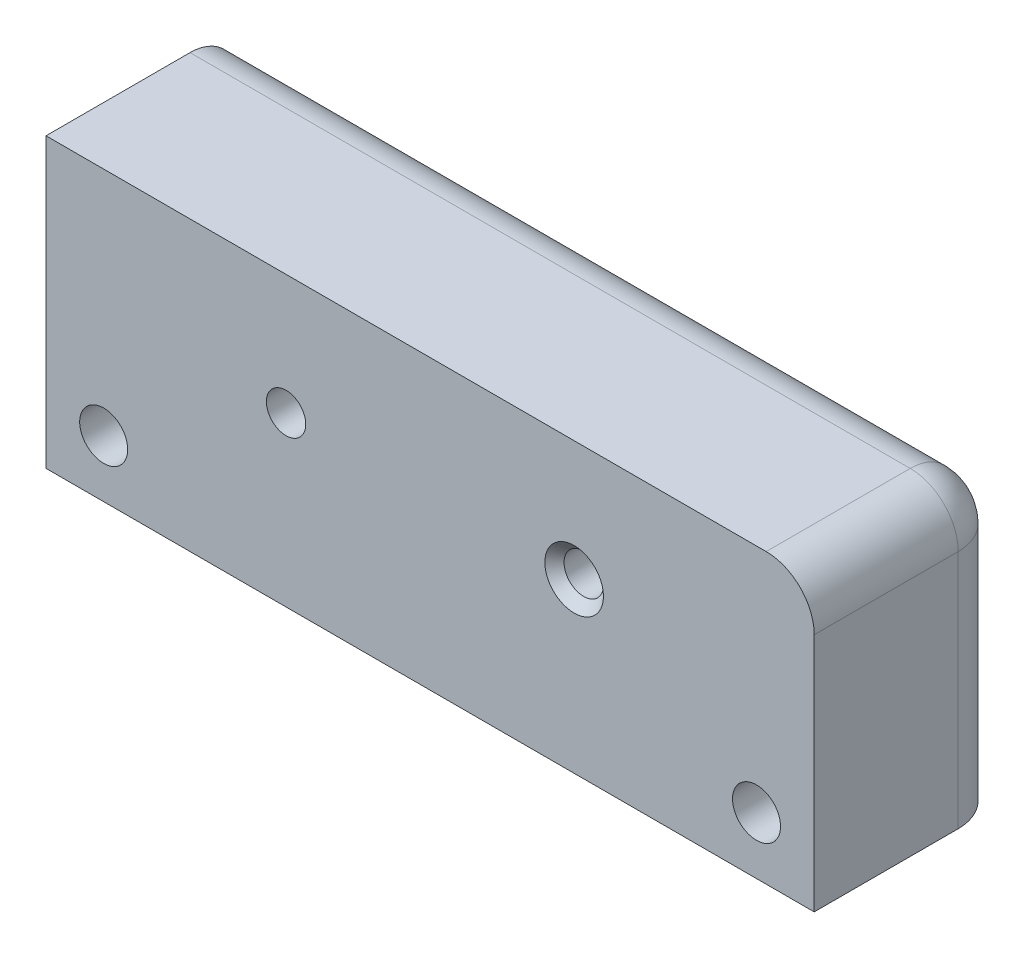
ISO-10303-21;
HEADER;
FILE_DESCRIPTION(('STEP AP214'),'2;1');
FILE_NAME('part.step','',(''),(''),'','','');
FILE_SCHEMA(('AUTOMOTIVE_DESIGN { 1 0 10303 214 1 1 1 1 }'));
ENDSEC;
DATA;
#1=APPLICATION_CONTEXT('core data for automotive mechanical design processes');
#2=APPLICATION_PROTOCOL_DEFINITION('international standard','automotive_design',2000,#1);
#3=PRODUCT_CONTEXT('',#1,'mechanical');
#4=PRODUCT('Part','Part','',(#3));
#5=PRODUCT_RELATED_PRODUCT_CATEGORY('part','',(#4));
#6=PRODUCT_DEFINITION_FORMATION('','',#4);
#7=PRODUCT_DEFINITION_CONTEXT('part definition',#1,'design');
#8=PRODUCT_DEFINITION('design','',#6,#7);
#9=PRODUCT_DEFINITION_SHAPE('','',#8);
#10=(LENGTH_UNIT() NAMED_UNIT(*) SI_UNIT(.MILLI.,.METRE.));
#11=(NAMED_UNIT(*) PLANE_ANGLE_UNIT() SI_UNIT($,.RADIAN.));
#12=(NAMED_UNIT(*) SI_UNIT($,.STERADIAN.) SOLID_ANGLE_UNIT());
#13=UNCERTAINTY_MEASURE_WITH_UNIT(LENGTH_MEASURE(1.E-05),#10,'distance_accuracy_value','');
#14=(GEOMETRIC_REPRESENTATION_CONTEXT(3) GLOBAL_UNCERTAINTY_ASSIGNED_CONTEXT((#13)) GLOBAL_UNIT_ASSIGNED_CONTEXT((#10,
#11,#12)) REPRESENTATION_CONTEXT('',''));
#15=CARTESIAN_POINT('',(0.,0.,0.));
#16=DIRECTION('',(0.,0.,1.));
#17=DIRECTION('',(1.,0.,0.));
#18=AXIS2_PLACEMENT_3D('',#15,#16,#17);
#19=CARTESIAN_POINT('',(0.,60.,0.));
#20=DIRECTION('',(1.,0.,0.));
#21=DIRECTION('',(0.,0.,-1.));
#22=AXIS2_PLACEMENT_3D('',#19,#20,#21);
#23=PLANE('',#22);
#24=DIRECTION('',(0.,0.,1.));
#25=VECTOR('',#24,1.);
#26=CARTESIAN_POINT('',(0.,60.,0.));
#27=LINE('',#26,#25);
#28=CARTESIAN_POINT('',(0.,60.,-30.));
#29=VERTEX_POINT('',#28);
#30=CARTESIAN_POINT('',(0.,60.,0.));
#31=VERTEX_POINT('',#30);
#32=EDGE_CURVE('E127',#29,#31,#27,.T.);
#33=ORIENTED_EDGE('',*,*,#32,.F.);
#34=CARTESIAN_POINT('',(0.,50.,-30.));
#35=DIRECTION('',(1.,0.,0.));
#36=DIRECTION('',(0.,0.,-1.));
#37=AXIS2_PLACEMENT_3D('',#34,#35,#36);
#38=CIRCLE('',#37,10.);
#39=CARTESIAN_POINT('',(0.,50.,-40.));
#40=VERTEX_POINT('',#39);
#41=EDGE_CURVE('E188',#29,#40,#38,.F.);
#42=ORIENTED_EDGE('',*,*,#41,.T.);
#43=DIRECTION('',(0.,-1.,0.));
#44=VECTOR('',#43,1.);
#45=CARTESIAN_POINT('',(0.,60.,-40.));
#46=LINE('',#45,#44);
#47=CARTESIAN_POINT('',(0.,0.,-40.));
#48=VERTEX_POINT('',#47);
#49=EDGE_CURVE('E133',#40,#48,#46,.T.);
#50=ORIENTED_EDGE('',*,*,#49,.T.);
#51=DIRECTION('',(0.,0.,1.));
#52=VECTOR('',#51,1.);
#53=CARTESIAN_POINT('',(0.,0.,0.));
#54=LINE('',#53,#52);
#55=CARTESIAN_POINT('',(0.,0.,0.));
#56=VERTEX_POINT('',#55);
#57=EDGE_CURVE('E124',#48,#56,#54,.T.);
#58=ORIENTED_EDGE('',*,*,#57,.T.);
#59=DIRECTION('',(0.,-1.,0.));
#60=VECTOR('',#59,1.);
#61=CARTESIAN_POINT('',(0.,60.,0.));
#62=LINE('',#61,#60);
#63=EDGE_CURVE('E121',#31,#56,#62,.T.);
#64=ORIENTED_EDGE('',*,*,#63,.F.);
#65=EDGE_LOOP('',(#33,#42,#50,#58,#64));
#66=FACE_BOUND('',#65,.T.);
#67=ADVANCED_FACE('F36',(#66),#23,.F.);
#68=CARTESIAN_POINT('',(0.,60.,0.));
#69=DIRECTION('',(0.,0.,-1.));
#70=DIRECTION('',(-1.,0.,0.));
#71=AXIS2_PLACEMENT_3D('',#68,#69,#70);
#72=PLANE('',#71);
#73=CARTESIAN_POINT('',(110.,35.,0.));
#74=DIRECTION('',(0.,0.,-1.));
#75=DIRECTION('',(-1.,0.,0.));
#76=AXIS2_PLACEMENT_3D('',#73,#74,#75);
#77=CIRCLE('',#76,6.09999999999999);
#78=CARTESIAN_POINT('',(103.9,35.,0.));
#79=VERTEX_POINT('',#78);
#80=EDGE_CURVE('E44',#79,#79,#77,.T.);
#81=ORIENTED_EDGE('',*,*,#80,.T.);
#82=EDGE_LOOP('',(#81));
#83=FACE_BOUND('',#82,.T.);
#84=CARTESIAN_POINT('',(50.,35.,0.));
#85=DIRECTION('',(0.,0.,1.));
#86=DIRECTION('',(1.,0.,0.));
#87=AXIS2_PLACEMENT_3D('',#84,#85,#86);
#88=CIRCLE('',#87,4.09999999999999);
#89=CARTESIAN_POINT('',(54.1,35.,0.));
#90=VERTEX_POINT('',#89);
#91=EDGE_CURVE('E105',#90,#90,#88,.T.);
#92=ORIENTED_EDGE('',*,*,#91,.F.);
#93=EDGE_LOOP('',(#92));
#94=FACE_BOUND('',#93,.T.);
#95=CARTESIAN_POINT('',(12.0133308099639,11.9072218747647,0.));
#96=DIRECTION('',(0.,0.,1.));
#97=DIRECTION('',(1.,0.,0.));
#98=AXIS2_PLACEMENT_3D('',#95,#96,#97);
#99=CIRCLE('',#98,5.);
#100=CARTESIAN_POINT('',(17.0133308099639,11.9072218747647,0.));
#101=VERTEX_POINT('',#100);
#102=EDGE_CURVE('E194',#101,#101,#99,.T.);
#103=ORIENTED_EDGE('',*,*,#102,.F.);
#104=EDGE_LOOP('',(#103));
#105=FACE_BOUND('',#104,.T.);
#106=DIRECTION('',(0.,-1.,0.));
#107=VECTOR('',#106,1.);
#108=CARTESIAN_POINT('',(160.,60.,0.));
#109=LINE('',#108,#107);
#110=CARTESIAN_POINT('',(160.,50.,0.));
#111=VERTEX_POINT('',#110);
#112=CARTESIAN_POINT('',(160.,0.,0.));
#113=VERTEX_POINT('',#112);
#114=EDGE_CURVE('E98',#111,#113,#109,.T.);
#115=ORIENTED_EDGE('',*,*,#114,.F.);
#116=CARTESIAN_POINT('',(150.,50.,0.));
#117=DIRECTION('',(0.,0.,-1.));
#118=DIRECTION('',(-1.,0.,0.));
#119=AXIS2_PLACEMENT_3D('',#116,#117,#118);
#120=CIRCLE('',#119,10.);
#121=CARTESIAN_POINT('',(150.,60.,0.));
#122=VERTEX_POINT('',#121);
#123=EDGE_CURVE('E224',#111,#122,#120,.F.);
#124=ORIENTED_EDGE('',*,*,#123,.T.);
#125=DIRECTION('',(1.,0.,0.));
#126=VECTOR('',#125,1.);
#127=CARTESIAN_POINT('',(0.,60.,0.));
#128=LINE('',#127,#126);
#129=EDGE_CURVE('E135',#31,#122,#128,.T.);
#130=ORIENTED_EDGE('',*,*,#129,.F.);
#131=ORIENTED_EDGE('',*,*,#63,.T.);
#132=DIRECTION('',(1.,0.,0.));
#133=VECTOR('',#132,1.);
#134=CARTESIAN_POINT('',(0.,0.,0.));
#135=LINE('',#134,#133);
#136=EDGE_CURVE('E111',#56,#113,#135,.T.);
#137=ORIENTED_EDGE('',*,*,#136,.T.);
#138=EDGE_LOOP('',(#115,#124,#130,#131,#137));
#139=FACE_BOUND('',#138,.T.);
#140=CARTESIAN_POINT('',(147.986669190036,11.9072218747647,0.));
#141=DIRECTION('',(0.,0.,-1.));
#142=DIRECTION('',(-1.,0.,0.));
#143=AXIS2_PLACEMENT_3D('',#140,#141,#142);
#144=CIRCLE('',#143,5.);
#145=CARTESIAN_POINT('',(142.986669190036,11.9072218747647,0.));
#146=VERTEX_POINT('',#145);
#147=EDGE_CURVE('E204',#146,#146,#144,.T.);
#148=ORIENTED_EDGE('',*,*,#147,.T.);
#149=EDGE_LOOP('',(#148));
#150=FACE_BOUND('',#149,.T.);
#151=ADVANCED_FACE('F117',(#83,#94,#105,#139,#150),#72,.F.);
#152=CARTESIAN_POINT('',(0.,60.,-40.));
#153=DIRECTION('',(0.,0.,1.));
#154=DIRECTION('',(1.,0.,0.));
#155=AXIS2_PLACEMENT_3D('',#152,#153,#154);
#156=PLANE('',#155);
#157=CARTESIAN_POINT('',(50.,35.,-40.));
#158=DIRECTION('',(0.,0.,1.));
#159=DIRECTION('',(1.,0.,0.));
#160=AXIS2_PLACEMENT_3D('',#157,#158,#159);
#161=CIRCLE('',#160,4.09999999999999);
#162=CARTESIAN_POINT('',(54.1,35.,-40.));
#163=VERTEX_POINT('',#162);
#164=EDGE_CURVE('E197',#163,#163,#161,.T.);
#165=ORIENTED_EDGE('',*,*,#164,.T.);
#166=EDGE_LOOP('',(#165));
#167=FACE_BOUND('',#166,.T.);
#168=CARTESIAN_POINT('',(12.0133308099639,11.9072218747647,-40.));
#169=DIRECTION('',(0.,0.,1.));
#170=DIRECTION('',(1.,0.,0.));
#171=AXIS2_PLACEMENT_3D('',#168,#169,#170);
#172=CIRCLE('',#171,5.);
#173=CARTESIAN_POINT('',(17.0133308099639,11.9072218747647,-40.));
#174=VERTEX_POINT('',#173);
#175=EDGE_CURVE('E129',#174,#174,#172,.T.);
#176=ORIENTED_EDGE('',*,*,#175,.T.);
#177=EDGE_LOOP('',(#176));
#178=FACE_BOUND('',#177,.T.);
#179=CARTESIAN_POINT('',(110.,35.,-40.));
#180=DIRECTION('',(0.,0.,-1.));
#181=DIRECTION('',(-1.,0.,0.));
#182=AXIS2_PLACEMENT_3D('',#179,#180,#181);
#183=CIRCLE('',#182,4.09999999999999);
#184=CARTESIAN_POINT('',(105.9,35.,-40.));
#185=VERTEX_POINT('',#184);
#186=EDGE_CURVE('E207',#185,#185,#183,.T.);
#187=ORIENTED_EDGE('',*,*,#186,.F.);
#188=EDGE_LOOP('',(#187));
#189=FACE_BOUND('',#188,.T.);
#190=ORIENTED_EDGE('',*,*,#49,.F.);
#191=DIRECTION('',(-1.,0.,0.));
#192=VECTOR('',#191,1.);
#193=CARTESIAN_POINT('',(0.,50.,-40.));
#194=LINE('',#193,#192);
#195=CARTESIAN_POINT('',(150.,50.,-40.));
#196=VERTEX_POINT('',#195);
#197=EDGE_CURVE('E229',#40,#196,#194,.F.);
#198=ORIENTED_EDGE('',*,*,#197,.T.);
#199=DIRECTION('',(0.,-1.,0.));
#200=VECTOR('',#199,1.);
#201=CARTESIAN_POINT('',(150.,60.,-40.));
#202=LINE('',#201,#200);
#203=CARTESIAN_POINT('',(150.,16.483956414767,-40.));
#204=VERTEX_POINT('',#203);
#205=EDGE_CURVE('E139',#196,#204,#202,.T.);
#206=ORIENTED_EDGE('',*,*,#205,.T.);
#207=CARTESIAN_POINT('',(147.986669190036,11.9072218747647,-40.));
#208=DIRECTION('',(0.,0.,-1.));
#209=DIRECTION('',(-1.,0.,0.));
#210=AXIS2_PLACEMENT_3D('',#207,#208,#209);
#211=CIRCLE('',#210,5.);
#212=CARTESIAN_POINT('',(150.,7.33048733476237,-40.));
#213=VERTEX_POINT('',#212);
#214=EDGE_CURVE('E115',#213,#204,#211,.T.);
#215=ORIENTED_EDGE('',*,*,#214,.F.);
#216=DIRECTION('',(0.,-1.,0.));
#217=VECTOR('',#216,1.);
#218=CARTESIAN_POINT('',(150.,60.,-40.));
#219=LINE('',#218,#217);
#220=CARTESIAN_POINT('',(150.,0.,-40.));
#221=VERTEX_POINT('',#220);
#222=EDGE_CURVE('E137',#213,#221,#219,.T.);
#223=ORIENTED_EDGE('',*,*,#222,.T.);
#224=DIRECTION('',(-1.,0.,0.));
#225=VECTOR('',#224,1.);
#226=CARTESIAN_POINT('',(0.,0.,-40.));
#227=LINE('',#226,#225);
#228=EDGE_CURVE('E123',#221,#48,#227,.T.);
#229=ORIENTED_EDGE('',*,*,#228,.T.);
#230=EDGE_LOOP('',(#190,#198,#206,#215,#223,#229));
#231=FACE_BOUND('',#230,.T.);
#232=ADVANCED_FACE('F174',(#167,#178,#189,#231),#156,.F.);
#233=CARTESIAN_POINT('',(0.,60.,0.));
#234=DIRECTION('',(0.,-1.,0.));
#235=DIRECTION('',(0.,0.,-1.));
#236=AXIS2_PLACEMENT_3D('',#233,#234,#235);
#237=PLANE('',#236);
#238=DIRECTION('',(0.,0.,1.));
#239=VECTOR('',#238,1.);
#240=CARTESIAN_POINT('',(150.,60.,0.));
#241=LINE('',#240,#239);
#242=CARTESIAN_POINT('',(150.,60.,-30.));
#243=VERTEX_POINT('',#242);
#244=EDGE_CURVE('E234',#122,#243,#241,.F.);
#245=ORIENTED_EDGE('',*,*,#244,.T.);
#246=DIRECTION('',(-1.,0.,0.));
#247=VECTOR('',#246,1.);
#248=CARTESIAN_POINT('',(0.,60.,-30.));
#249=LINE('',#248,#247);
#250=EDGE_CURVE('E232',#243,#29,#249,.T.);
#251=ORIENTED_EDGE('',*,*,#250,.T.);
#252=ORIENTED_EDGE('',*,*,#32,.T.);
#253=ORIENTED_EDGE('',*,*,#129,.T.);
#254=EDGE_LOOP('',(#245,#251,#252,#253));
#255=FACE_BOUND('',#254,.T.);
#256=ADVANCED_FACE('F171',(#255),#237,.F.);
#257=CARTESIAN_POINT('',(0.,0.,0.));
#258=DIRECTION('',(0.,-1.,0.));
#259=DIRECTION('',(0.,0.,-1.));
#260=AXIS2_PLACEMENT_3D('',#257,#258,#259);
#261=PLANE('',#260);
#262=ORIENTED_EDGE('',*,*,#228,.F.);
#263=CARTESIAN_POINT('',(150.,0.,-30.));
#264=DIRECTION('',(0.,-1.,0.));
#265=DIRECTION('',(0.,0.,-1.));
#266=AXIS2_PLACEMENT_3D('',#263,#264,#265);
#267=CIRCLE('',#266,10.);
#268=CARTESIAN_POINT('',(160.,0.,-30.));
#269=VERTEX_POINT('',#268);
#270=EDGE_CURVE('E114',#221,#269,#267,.T.);
#271=ORIENTED_EDGE('',*,*,#270,.T.);
#272=DIRECTION('',(0.,0.,1.));
#273=VECTOR('',#272,1.);
#274=CARTESIAN_POINT('',(160.,0.,0.));
#275=LINE('',#274,#273);
#276=EDGE_CURVE('E101',#269,#113,#275,.T.);
#277=ORIENTED_EDGE('',*,*,#276,.T.);
#278=ORIENTED_EDGE('',*,*,#136,.F.);
#279=ORIENTED_EDGE('',*,*,#57,.F.);
#280=EDGE_LOOP('',(#262,#271,#277,#278,#279));
#281=FACE_BOUND('',#280,.T.);
#282=ADVANCED_FACE('F109',(#281),#261,.T.);
#283=CARTESIAN_POINT('',(12.0133308099639,11.9072218747647,-40.));
#284=DIRECTION('',(0.,0.,1.));
#285=DIRECTION('',(1.,0.,0.));
#286=AXIS2_PLACEMENT_3D('',#283,#284,#285);
#287=CYLINDRICAL_SURFACE('',#286,5.);
#288=ORIENTED_EDGE('',*,*,#175,.F.);
#289=EDGE_LOOP('',(#288));
#290=FACE_BOUND('',#289,.T.);
#291=ORIENTED_EDGE('',*,*,#102,.T.);
#292=EDGE_LOOP('',(#291));
#293=FACE_BOUND('',#292,.T.);
#294=ADVANCED_FACE('F166',(#290,#293),#287,.F.);
#295=CARTESIAN_POINT('',(50.,35.,0.));
#296=DIRECTION('',(0.,0.,1.));
#297=DIRECTION('',(1.,0.,0.));
#298=AXIS2_PLACEMENT_3D('',#295,#296,#297);
#299=CYLINDRICAL_SURFACE('',#298,4.09999999999999);
#300=ORIENTED_EDGE('',*,*,#164,.F.);
#301=EDGE_LOOP('',(#300));
#302=FACE_BOUND('',#301,.T.);
#303=ORIENTED_EDGE('',*,*,#91,.T.);
#304=EDGE_LOOP('',(#303));
#305=FACE_BOUND('',#304,.T.);
#306=ADVANCED_FACE('F163',(#302,#305),#299,.F.);
#307=CARTESIAN_POINT('',(160.,60.,0.));
#308=DIRECTION('',(-1.,0.,0.));
#309=DIRECTION('',(0.,0.,-1.));
#310=AXIS2_PLACEMENT_3D('',#307,#308,#309);
#311=PLANE('',#310);
#312=DIRECTION('',(0.,-1.,0.));
#313=VECTOR('',#312,1.);
#314=CARTESIAN_POINT('',(160.,60.,-30.));
#315=LINE('',#314,#313);
#316=CARTESIAN_POINT('',(160.,50.,-30.));
#317=VERTEX_POINT('',#316);
#318=EDGE_CURVE('E235',#269,#317,#315,.F.);
#319=ORIENTED_EDGE('',*,*,#318,.T.);
#320=DIRECTION('',(0.,0.,1.));
#321=VECTOR('',#320,1.);
#322=CARTESIAN_POINT('',(160.,50.,0.));
#323=LINE('',#322,#321);
#324=EDGE_CURVE('E51',#317,#111,#323,.T.);
#325=ORIENTED_EDGE('',*,*,#324,.T.);
#326=ORIENTED_EDGE('',*,*,#114,.T.);
#327=ORIENTED_EDGE('',*,*,#276,.F.);
#328=EDGE_LOOP('',(#319,#325,#326,#327));
#329=FACE_BOUND('',#328,.T.);
#330=ADVANCED_FACE('F100',(#329),#311,.F.);
#331=CARTESIAN_POINT('',(147.986669190036,11.9072218747647,-40.));
#332=DIRECTION('',(0.,0.,1.));
#333=DIRECTION('',(-1.,0.,0.));
#334=AXIS2_PLACEMENT_3D('',#331,#332,#333);
#335=CYLINDRICAL_SURFACE('',#334,5.);
#336=ORIENTED_EDGE('',*,*,#214,.T.);
#337=CARTESIAN_POINT('',(150.,16.483956414767,-40.));
#338=CARTESIAN_POINT('',(150.126123932841,16.4284935597822,-40.0000154082951));
#339=CARTESIAN_POINT('',(150.249913025489,16.3677971603017,-39.9976142768596));
#340=CARTESIAN_POINT('',(150.491897088129,16.2365087824249,-39.9886239346022));
#341=CARTESIAN_POINT('',(150.610094674696,16.1659214950365,-39.98203670394));
#342=CARTESIAN_POINT('',(150.839785858685,16.0155698901453,-39.965340226733));
#343=CARTESIAN_POINT('',(150.951296473428,15.9358305160597,-39.9552404076727));
#344=CARTESIAN_POINT('',(151.167209698601,15.7676507421388,-39.932241373681));
#345=CARTESIAN_POINT('',(151.271611595002,15.6792094704258,-39.9193418780822));
#346=CARTESIAN_POINT('',(151.572879737568,15.4019843020819,-39.8776029784247));
#347=CARTESIAN_POINT('',(151.758313463852,15.2009671694739,-39.8456804404186));
#348=CARTESIAN_POINT('',(152.093905397891,14.7716615847236,-39.7798236302366));
#349=CARTESIAN_POINT('',(152.244040168597,14.5433551644856,-39.7458880400946));
#350=CARTESIAN_POINT('',(152.510141754963,14.0561568591051,-39.6808404936616));
#351=CARTESIAN_POINT('',(152.624672607397,13.7964562322359,-39.6498754979502));
#352=CARTESIAN_POINT('',(152.808354967938,13.2605606248552,-39.5980389694611));
#353=CARTESIAN_POINT('',(152.877522657098,12.9843715641681,-39.5771638383253));
#354=CARTESIAN_POINT('',(152.96704727834,12.4297056935743,-39.5498066947902));
#355=CARTESIAN_POINT('',(152.988443062383,12.1514124143376,-39.5430185811829));
#356=CARTESIAN_POINT('',(152.984665271326,11.5952015493716,-39.5442016677529));
#357=CARTESIAN_POINT('',(152.959498377516,11.3172839154671,-39.5521707504164));
#358=CARTESIAN_POINT('',(152.865168582992,10.779194714688,-39.5808703835774));
#359=CARTESIAN_POINT('',(152.797472727092,10.5187400400451,-39.6011746865668));
#360=CARTESIAN_POINT('',(152.621609929582,10.0127301983879,-39.6506705008104));
#361=CARTESIAN_POINT('',(152.513430156747,9.76717978393012,-39.6798648291776));
#362=CARTESIAN_POINT('',(152.255549680399,9.28945285182438,-39.7432360186379));
#363=CARTESIAN_POINT('',(152.10464203637,9.05794656685088,-39.7775414379499));
#364=CARTESIAN_POINT('',(151.766585784706,8.62271022237683,-39.844221868866));
#365=CARTESIAN_POINT('',(151.579450931348,8.41896967100944,-39.8765976070242));
#366=CARTESIAN_POINT('',(151.275839734794,8.13890159027192,-39.9188018707106));
#367=CARTESIAN_POINT('',(151.171131704689,8.05000894226115,-39.9317834648779));
#368=CARTESIAN_POINT('',(150.954543757765,7.88098705711093,-39.9549333036885));
#369=CARTESIAN_POINT('',(150.842664591229,7.80085690555848,-39.965101842059));
#370=CARTESIAN_POINT('',(150.612210198903,7.6498102652574,-39.9819114510103));
#371=CARTESIAN_POINT('',(150.49361947841,7.57891645776546,-39.9885439572636));
#372=CARTESIAN_POINT('',(150.250804963625,7.44708386645338,-39.9975970495122));
#373=CARTESIAN_POINT('',(150.126578489687,7.38614988299797,-40.0000156098927));
#374=CARTESIAN_POINT('',(150.,7.33048733476237,-40.));
#375=B_SPLINE_CURVE_WITH_KNOTS('',3,(#337,#338,#339,#340,#341,#342,#343,#344,#345,#346,#347,
#348,#349,#350,#351,#352,#353,#354,#355,#356,#357,#358,#359,#360,#361,#362,#363,#364,#365,#366,
#367,#368,#369,#370,#371,#372,#373,#374),.UNSPECIFIED.,.F.,.F.,(4,2,2,2,2,2,2,2,2,2,2,2,2,2,2,2,
2,2,4),(0.,0.413155267831177,0.826115245249724,1.23797531955848,1.64987670187095,
2.47188439212345,3.29443632990256,4.14680738908944,4.99887424166446,5.83222368831477,
6.66545356671046,7.47141008966134,8.27762227415331,9.10937826245996,9.9408190775917,
10.3543087173074,10.7677551659247,11.1821984910122,11.5968409812518),.UNSPECIFIED.);
#376=EDGE_CURVE('E141',#204,#213,#375,.T.);
#377=ORIENTED_EDGE('',*,*,#376,.T.);
#378=EDGE_LOOP('',(#336,#377));
#379=FACE_BOUND('',#378,.T.);
#380=ORIENTED_EDGE('',*,*,#147,.F.);
#381=EDGE_LOOP('',(#380));
#382=FACE_BOUND('',#381,.T.);
#383=ADVANCED_FACE('F154',(#379,#382),#335,.F.);
#384=CARTESIAN_POINT('',(110.,35.,0.));
#385=DIRECTION('',(0.,0.,1.));
#386=DIRECTION('',(-1.,0.,0.));
#387=AXIS2_PLACEMENT_3D('',#384,#385,#386);
#388=CYLINDRICAL_SURFACE('',#387,4.09999999999999);
#389=CARTESIAN_POINT('',(110.,35.,-2.00000000000002));
#390=DIRECTION('',(0.,0.,-1.));
#391=DIRECTION('',(-1.,0.,0.));
#392=AXIS2_PLACEMENT_3D('',#389,#390,#391);
#393=CIRCLE('',#392,4.09999999999999);
#394=CARTESIAN_POINT('',(105.9,35.,-2.00000000000002));
#395=VERTEX_POINT('',#394);
#396=EDGE_CURVE('E11',#395,#395,#393,.F.);
#397=ORIENTED_EDGE('',*,*,#396,.T.);
#398=EDGE_LOOP('',(#397));
#399=FACE_BOUND('',#398,.T.);
#400=ORIENTED_EDGE('',*,*,#186,.T.);
#401=EDGE_LOOP('',(#400));
#402=FACE_BOUND('',#401,.T.);
#403=ADVANCED_FACE('F159',(#399,#402),#388,.F.);
#404=CARTESIAN_POINT('',(150.,60.,-30.));
#405=DIRECTION('',(0.,-1.,0.));
#406=DIRECTION('',(0.,0.,-1.));
#407=AXIS2_PLACEMENT_3D('',#404,#405,#406);
#408=CYLINDRICAL_SURFACE('',#407,10.);
#409=ORIENTED_EDGE('',*,*,#205,.F.);
#410=CARTESIAN_POINT('',(150.,50.,-30.));
#411=DIRECTION('',(0.,-1.,0.));
#412=DIRECTION('',(0.,0.,-1.));
#413=AXIS2_PLACEMENT_3D('',#410,#411,#412);
#414=CIRCLE('',#413,10.);
#415=EDGE_CURVE('E59',#196,#317,#414,.T.);
#416=ORIENTED_EDGE('',*,*,#415,.T.);
#417=ORIENTED_EDGE('',*,*,#318,.F.);
#418=ORIENTED_EDGE('',*,*,#270,.F.);
#419=ORIENTED_EDGE('',*,*,#222,.F.);
#420=ORIENTED_EDGE('',*,*,#376,.F.);
#421=EDGE_LOOP('',(#409,#416,#417,#418,#419,#420));
#422=FACE_BOUND('',#421,.T.);
#423=ADVANCED_FACE('F150',(#422),#408,.T.);
#424=CARTESIAN_POINT('',(150.,50.,0.));
#425=DIRECTION('',(0.,0.,1.));
#426=DIRECTION('',(1.,0.,0.));
#427=AXIS2_PLACEMENT_3D('',#424,#425,#426);
#428=CYLINDRICAL_SURFACE('',#427,10.);
#429=ORIENTED_EDGE('',*,*,#123,.F.);
#430=ORIENTED_EDGE('',*,*,#324,.F.);
#431=CARTESIAN_POINT('',(150.,50.,-30.));
#432=DIRECTION('',(0.,0.,-1.));
#433=DIRECTION('',(-1.,0.,0.));
#434=AXIS2_PLACEMENT_3D('',#431,#432,#433);
#435=CIRCLE('',#434,10.);
#436=EDGE_CURVE('E211',#243,#317,#435,.T.);
#437=ORIENTED_EDGE('',*,*,#436,.F.);
#438=ORIENTED_EDGE('',*,*,#244,.F.);
#439=EDGE_LOOP('',(#429,#430,#437,#438));
#440=FACE_BOUND('',#439,.T.);
#441=ADVANCED_FACE('F237',(#440),#428,.T.);
#442=CARTESIAN_POINT('',(150.,50.,-30.));
#443=DIRECTION('',(0.,-1.,0.));
#444=DIRECTION('',(0.,0.,-1.));
#445=AXIS2_PLACEMENT_3D('',#442,#443,#444);
#446=SPHERICAL_SURFACE('',#445,10.);
#447=ORIENTED_EDGE('',*,*,#436,.T.);
#448=ORIENTED_EDGE('',*,*,#415,.F.);
#449=CARTESIAN_POINT('',(150.,50.,-30.));
#450=DIRECTION('',(-1.,0.,0.));
#451=DIRECTION('',(0.,0.,1.));
#452=AXIS2_PLACEMENT_3D('',#449,#450,#451);
#453=CIRCLE('',#452,10.);
#454=EDGE_CURVE('E215',#243,#196,#453,.T.);
#455=ORIENTED_EDGE('',*,*,#454,.F.);
#456=EDGE_LOOP('',(#447,#448,#455));
#457=FACE_BOUND('',#456,.T.);
#458=ADVANCED_FACE('F247',(#457),#446,.T.);
#459=CARTESIAN_POINT('',(0.,50.,-30.));
#460=DIRECTION('',(-1.,0.,0.));
#461=DIRECTION('',(0.,0.,1.));
#462=AXIS2_PLACEMENT_3D('',#459,#460,#461);
#463=CYLINDRICAL_SURFACE('',#462,10.);
#464=ORIENTED_EDGE('',*,*,#454,.T.);
#465=ORIENTED_EDGE('',*,*,#197,.F.);
#466=ORIENTED_EDGE('',*,*,#41,.F.);
#467=ORIENTED_EDGE('',*,*,#250,.F.);
#468=EDGE_LOOP('',(#464,#465,#466,#467));
#469=FACE_BOUND('',#468,.T.);
#470=ADVANCED_FACE('F241',(#469),#463,.T.);
#471=CARTESIAN_POINT('',(110.,35.,0.));
#472=DIRECTION('',(0.,0.,1.));
#473=DIRECTION('',(1.,0.,0.));
#474=AXIS2_PLACEMENT_3D('',#471,#472,#473);
#475=CONICAL_SURFACE('',#474,6.09999999999999,0.785398163397445);
#476=ORIENTED_EDGE('',*,*,#396,.F.);
#477=EDGE_LOOP('',(#476));
#478=FACE_BOUND('',#477,.T.);
#479=ORIENTED_EDGE('',*,*,#80,.F.);
#480=EDGE_LOOP('',(#479));
#481=FACE_BOUND('',#480,.T.);
#482=ADVANCED_FACE('F38',(#478,#481),#475,.F.);
#483=CLOSED_SHELL('',(#67,#151,#232,#256,#282,#294,#306,#330,#383,#403,#423,#441,#458,#470,#482));
#484=MANIFOLD_SOLID_BREP('B2',#483);
#485=ADVANCED_BREP_SHAPE_REPRESENTATION('',(#18,#484),#14);
#486=SHAPE_DEFINITION_REPRESENTATION(#9,#485);
ENDSEC;
END-ISO-10303-21;
